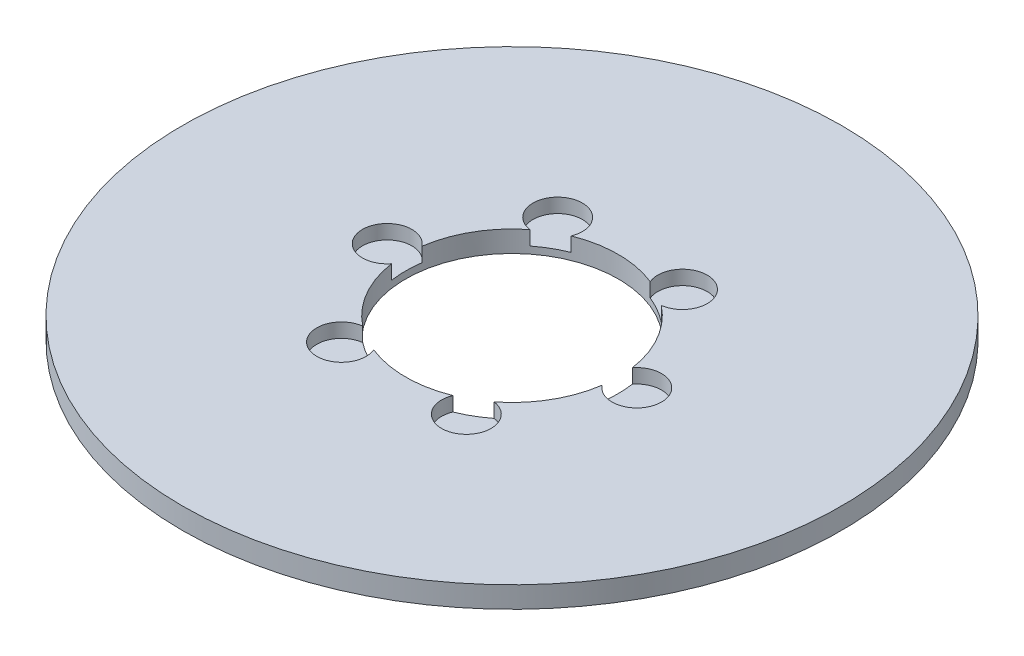
ISO-10303-21;
HEADER;
FILE_DESCRIPTION(('STEP AP214'),'2;1');
FILE_NAME('part.step','',(''),(''),'','','');
FILE_SCHEMA(('AUTOMOTIVE_DESIGN { 1 0 10303 214 1 1 1 1 }'));
ENDSEC;
DATA;
#1=APPLICATION_CONTEXT('core data for automotive mechanical design processes');
#2=APPLICATION_PROTOCOL_DEFINITION('international standard','automotive_design',2000,#1);
#3=PRODUCT_CONTEXT('',#1,'mechanical');
#4=PRODUCT('Part','Part','',(#3));
#5=PRODUCT_RELATED_PRODUCT_CATEGORY('part','',(#4));
#6=PRODUCT_DEFINITION_FORMATION('','',#4);
#7=PRODUCT_DEFINITION_CONTEXT('part definition',#1,'design');
#8=PRODUCT_DEFINITION('design','',#6,#7);
#9=PRODUCT_DEFINITION_SHAPE('','',#8);
#10=(LENGTH_UNIT() NAMED_UNIT(*) SI_UNIT(.MILLI.,.METRE.));
#11=(NAMED_UNIT(*) PLANE_ANGLE_UNIT() SI_UNIT($,.RADIAN.));
#12=(NAMED_UNIT(*) SI_UNIT($,.STERADIAN.) SOLID_ANGLE_UNIT());
#13=UNCERTAINTY_MEASURE_WITH_UNIT(LENGTH_MEASURE(1.E-05),#10,'distance_accuracy_value','');
#14=(GEOMETRIC_REPRESENTATION_CONTEXT(3) GLOBAL_UNCERTAINTY_ASSIGNED_CONTEXT((#13)) GLOBAL_UNIT_ASSIGNED_CONTEXT((#10,
#11,#12)) REPRESENTATION_CONTEXT('',''));
#15=CARTESIAN_POINT('',(0.,0.,0.));
#16=DIRECTION('',(0.,0.,1.));
#17=DIRECTION('',(1.,0.,0.));
#18=AXIS2_PLACEMENT_3D('',#15,#16,#17);
#19=CARTESIAN_POINT('',(0.,5.,0.));
#20=DIRECTION('',(0.,-1.,0.));
#21=DIRECTION('',(0.,0.,-1.));
#22=AXIS2_PLACEMENT_3D('',#19,#20,#21);
#23=CYLINDRICAL_SURFACE('',#22,77.5);
#24=CARTESIAN_POINT('',(0.,5.,0.));
#25=DIRECTION('',(0.,1.,0.));
#26=DIRECTION('',(0.,0.,1.));
#27=AXIS2_PLACEMENT_3D('',#24,#25,#26);
#28=CIRCLE('',#27,77.5);
#29=CARTESIAN_POINT('',(0.,5.,77.5));
#30=VERTEX_POINT('',#29);
#31=EDGE_CURVE('E171',#30,#30,#28,.T.);
#32=ORIENTED_EDGE('',*,*,#31,.F.);
#33=EDGE_LOOP('',(#32));
#34=FACE_BOUND('',#33,.T.);
#35=CARTESIAN_POINT('',(0.,0.,0.));
#36=DIRECTION('',(0.,1.,0.));
#37=DIRECTION('',(0.,0.,1.));
#38=AXIS2_PLACEMENT_3D('',#35,#36,#37);
#39=CIRCLE('',#38,77.5);
#40=CARTESIAN_POINT('',(0.,0.,77.5));
#41=VERTEX_POINT('',#40);
#42=EDGE_CURVE('E157',#41,#41,#39,.T.);
#43=ORIENTED_EDGE('',*,*,#42,.T.);
#44=EDGE_LOOP('',(#43));
#45=FACE_BOUND('',#44,.T.);
#46=ADVANCED_FACE('F39',(#34,#45),#23,.T.);
#47=CARTESIAN_POINT('',(0.,5.,0.));
#48=DIRECTION('',(0.,1.,0.));
#49=DIRECTION('',(0.,0.,1.));
#50=AXIS2_PLACEMENT_3D('',#47,#48,#49);
#51=PLANE('',#50);
#52=CARTESIAN_POINT('',(-14.675311446029,5.,-25.4183850414186));
#53=DIRECTION('',(0.,1.,0.));
#54=DIRECTION('',(-0.866025403784433,0.,0.50000000000001));
#55=AXIS2_PLACEMENT_3D('',#52,#53,#54);
#56=CIRCLE('',#55,5.81681843689222);
#57=CARTESIAN_POINT('',(-9.29488499058045,5.,-23.2078674809187));
#58=VERTEX_POINT('',#57);
#59=CARTESIAN_POINT('',(-15.4511603108486,5.,-19.6535402675563));
#60=VERTEX_POINT('',#59);
#61=EDGE_CURVE('E214',#58,#60,#56,.T.);
#62=ORIENTED_EDGE('',*,*,#61,.F.);
#63=CARTESIAN_POINT('',(0.,5.,0.));
#64=DIRECTION('',(0.,1.,0.));
#65=DIRECTION('',(0.,0.,1.));
#66=AXIS2_PLACEMENT_3D('',#63,#64,#65);
#67=CIRCLE('',#66,25.);
#68=CARTESIAN_POINT('',(9.29488499057996,5.,-23.2078674809189));
#69=VERTEX_POINT('',#68);
#70=EDGE_CURVE('E272',#69,#58,#67,.T.);
#71=ORIENTED_EDGE('',*,*,#70,.F.);
#72=CARTESIAN_POINT('',(14.6753114460285,5.,-25.4183850414189));
#73=DIRECTION('',(0.,1.,0.));
#74=DIRECTION('',(-0.866025403784443,0.,-0.499999999999992));
#75=AXIS2_PLACEMENT_3D('',#72,#73,#74);
#76=CIRCLE('',#75,5.81681843689222);
#77=CARTESIAN_POINT('',(15.4511603108482,5.,-19.6535402675567));
#78=VERTEX_POINT('',#77);
#79=EDGE_CURVE('E285',#78,#69,#76,.T.);
#80=ORIENTED_EDGE('',*,*,#79,.F.);
#81=CARTESIAN_POINT('',(24.7460453014285,5.,-3.55432721336227));
#82=VERTEX_POINT('',#81);
#83=EDGE_CURVE('E165',#82,#78,#67,.T.);
#84=ORIENTED_EDGE('',*,*,#83,.F.);
#85=CARTESIAN_POINT('',(29.3506228920574,5.,0.));
#86=DIRECTION('',(0.,1.,0.));
#87=DIRECTION('',(0.,0.,-1.));
#88=AXIS2_PLACEMENT_3D('',#85,#86,#87);
#89=CIRCLE('',#88,5.81681843689222);
#90=CARTESIAN_POINT('',(24.7460453014285,5.,3.55432721336227));
#91=VERTEX_POINT('',#90);
#92=EDGE_CURVE('E281',#91,#82,#89,.T.);
#93=ORIENTED_EDGE('',*,*,#92,.F.);
#94=CARTESIAN_POINT('',(15.4511603108484,5.,19.6535402675564));
#95=VERTEX_POINT('',#94);
#96=EDGE_CURVE('E160',#95,#91,#67,.T.);
#97=ORIENTED_EDGE('',*,*,#96,.F.);
#98=CARTESIAN_POINT('',(14.6753114460288,5.,25.4183850414187));
#99=DIRECTION('',(0.,1.,0.));
#100=DIRECTION('',(0.866025403784436,0.,-0.500000000000004));
#101=AXIS2_PLACEMENT_3D('',#98,#99,#100);
#102=CIRCLE('',#101,5.81681843689222);
#103=CARTESIAN_POINT('',(9.29488499058029,5.,23.2078674809187));
#104=VERTEX_POINT('',#103);
#105=EDGE_CURVE('E154',#104,#95,#102,.T.);
#106=ORIENTED_EDGE('',*,*,#105,.F.);
#107=CARTESIAN_POINT('',(-9.29488499058013,5.,23.2078674809188));
#108=VERTEX_POINT('',#107);
#109=EDGE_CURVE('E150',#108,#104,#67,.T.);
#110=ORIENTED_EDGE('',*,*,#109,.F.);
#111=CARTESIAN_POINT('',(-14.6753114460286,5.,25.4183850414188));
#112=DIRECTION('',(0.,1.,0.));
#113=DIRECTION('',(0.86602540378444,0.,0.499999999999998));
#114=AXIS2_PLACEMENT_3D('',#111,#112,#113);
#115=CIRCLE('',#114,5.81681843689222);
#116=CARTESIAN_POINT('',(-15.4511603108483,5.,19.6535402675565));
#117=VERTEX_POINT('',#116);
#118=EDGE_CURVE('E127',#117,#108,#115,.T.);
#119=ORIENTED_EDGE('',*,*,#118,.F.);
#120=CARTESIAN_POINT('',(-24.7460453014285,5.,3.55432721336227));
#121=VERTEX_POINT('',#120);
#122=EDGE_CURVE('E156',#121,#117,#67,.T.);
#123=ORIENTED_EDGE('',*,*,#122,.F.);
#124=CARTESIAN_POINT('',(-29.3506228920574,5.,0.));
#125=DIRECTION('',(0.,1.,0.));
#126=DIRECTION('',(0.,0.,1.));
#127=AXIS2_PLACEMENT_3D('',#124,#125,#126);
#128=CIRCLE('',#127,5.81681843689222);
#129=CARTESIAN_POINT('',(-24.7460453014285,5.,-3.55432721336227));
#130=VERTEX_POINT('',#129);
#131=EDGE_CURVE('E164',#130,#121,#128,.T.);
#132=ORIENTED_EDGE('',*,*,#131,.F.);
#133=EDGE_CURVE('E159',#60,#130,#67,.T.);
#134=ORIENTED_EDGE('',*,*,#133,.F.);
#135=EDGE_LOOP('',(#62,#71,#80,#84,#93,#97,#106,#110,#119,#123,#132,#134));
#136=FACE_BOUND('',#135,.T.);
#137=ORIENTED_EDGE('',*,*,#31,.T.);
#138=EDGE_LOOP('',(#137));
#139=FACE_BOUND('',#138,.T.);
#140=ADVANCED_FACE('F155',(#136,#139),#51,.T.);
#141=CARTESIAN_POINT('',(0.,0.,0.));
#142=DIRECTION('',(0.,1.,0.));
#143=DIRECTION('',(0.,0.,1.));
#144=AXIS2_PLACEMENT_3D('',#141,#142,#143);
#145=PLANE('',#144);
#146=CARTESIAN_POINT('',(0.,0.,0.));
#147=DIRECTION('',(0.,1.,0.));
#148=DIRECTION('',(0.,0.,1.));
#149=AXIS2_PLACEMENT_3D('',#146,#147,#148);
#150=CIRCLE('',#149,25.);
#151=CARTESIAN_POINT('',(0.,0.,25.));
#152=VERTEX_POINT('',#151);
#153=EDGE_CURVE('E170',#152,#152,#150,.T.);
#154=ORIENTED_EDGE('',*,*,#153,.T.);
#155=EDGE_LOOP('',(#154));
#156=FACE_BOUND('',#155,.T.);
#157=ORIENTED_EDGE('',*,*,#42,.F.);
#158=EDGE_LOOP('',(#157));
#159=FACE_BOUND('',#158,.T.);
#160=ADVANCED_FACE('F232',(#156,#159),#145,.F.);
#161=CARTESIAN_POINT('',(0.,5.,0.));
#162=DIRECTION('',(0.,-1.,0.));
#163=DIRECTION('',(0.,0.,-1.));
#164=AXIS2_PLACEMENT_3D('',#161,#162,#163);
#165=CYLINDRICAL_SURFACE('',#164,25.);
#166=DIRECTION('',(0.,1.,0.));
#167=VECTOR('',#166,1.);
#168=CARTESIAN_POINT('',(-9.29488499058045,3.32190202218176,-23.2078674809187));
#169=LINE('',#168,#167);
#170=CARTESIAN_POINT('',(-9.29488499058045,1.64380404436351,-23.2078674809187));
#171=VERTEX_POINT('',#170);
#172=EDGE_CURVE('E11',#171,#58,#169,.T.);
#173=ORIENTED_EDGE('',*,*,#172,.F.);
#174=CARTESIAN_POINT('',(0.,1.64380404436351,0.));
#175=DIRECTION('',(0.,1.,0.));
#176=DIRECTION('',(0.,0.,1.));
#177=AXIS2_PLACEMENT_3D('',#174,#175,#176);
#178=CIRCLE('',#177,25.);
#179=CARTESIAN_POINT('',(-15.4511603108486,1.64380404436351,-19.6535402675563));
#180=VERTEX_POINT('',#179);
#181=EDGE_CURVE('E209',#171,#180,#178,.T.);
#182=ORIENTED_EDGE('',*,*,#181,.T.);
#183=DIRECTION('',(0.,1.,0.));
#184=VECTOR('',#183,1.);
#185=CARTESIAN_POINT('',(-15.4511603108486,3.32190202218176,-19.6535402675563));
#186=LINE('',#185,#184);
#187=EDGE_CURVE('E46',#60,#180,#186,.F.);
#188=ORIENTED_EDGE('',*,*,#187,.F.);
#189=ORIENTED_EDGE('',*,*,#133,.T.);
#190=DIRECTION('',(0.,1.,0.));
#191=VECTOR('',#190,1.);
#192=CARTESIAN_POINT('',(-24.7460453014285,3.32190202218176,-3.55432721336227));
#193=LINE('',#192,#191);
#194=CARTESIAN_POINT('',(-24.7460453014285,1.64380404436351,-3.55432721336227));
#195=VERTEX_POINT('',#194);
#196=EDGE_CURVE('E185',#195,#130,#193,.T.);
#197=ORIENTED_EDGE('',*,*,#196,.F.);
#198=CARTESIAN_POINT('',(0.,1.64380404436351,0.));
#199=DIRECTION('',(0.,1.,0.));
#200=DIRECTION('',(0.,0.,1.));
#201=AXIS2_PLACEMENT_3D('',#198,#199,#200);
#202=CIRCLE('',#201,25.);
#203=CARTESIAN_POINT('',(-24.7460453014285,1.64380404436351,3.55432721336227));
#204=VERTEX_POINT('',#203);
#205=EDGE_CURVE('E173',#195,#204,#202,.T.);
#206=ORIENTED_EDGE('',*,*,#205,.T.);
#207=DIRECTION('',(0.,1.,0.));
#208=VECTOR('',#207,1.);
#209=CARTESIAN_POINT('',(-24.7460453014285,3.32190202218176,3.55432721336227));
#210=LINE('',#209,#208);
#211=EDGE_CURVE('E178',#121,#204,#210,.F.);
#212=ORIENTED_EDGE('',*,*,#211,.F.);
#213=ORIENTED_EDGE('',*,*,#122,.T.);
#214=DIRECTION('',(0.,1.,0.));
#215=VECTOR('',#214,1.);
#216=CARTESIAN_POINT('',(-15.4511603108483,3.32190202218176,19.6535402675565));
#217=LINE('',#216,#215);
#218=CARTESIAN_POINT('',(-15.4511603108483,1.64380404436351,19.6535402675565));
#219=VERTEX_POINT('',#218);
#220=EDGE_CURVE('E132',#219,#117,#217,.T.);
#221=ORIENTED_EDGE('',*,*,#220,.F.);
#222=CARTESIAN_POINT('',(0.,1.64380404436351,0.));
#223=DIRECTION('',(0.,1.,0.));
#224=DIRECTION('',(0.,0.,1.));
#225=AXIS2_PLACEMENT_3D('',#222,#223,#224);
#226=CIRCLE('',#225,25.);
#227=CARTESIAN_POINT('',(-9.29488499058013,1.64380404436351,23.2078674809188));
#228=VERTEX_POINT('',#227);
#229=EDGE_CURVE('E146',#219,#228,#226,.T.);
#230=ORIENTED_EDGE('',*,*,#229,.T.);
#231=DIRECTION('',(0.,1.,0.));
#232=VECTOR('',#231,1.);
#233=CARTESIAN_POINT('',(-9.29488499058012,3.32190202218176,23.2078674809188));
#234=LINE('',#233,#232);
#235=EDGE_CURVE('E128',#108,#228,#234,.F.);
#236=ORIENTED_EDGE('',*,*,#235,.F.);
#237=ORIENTED_EDGE('',*,*,#109,.T.);
#238=DIRECTION('',(0.,1.,0.));
#239=VECTOR('',#238,1.);
#240=CARTESIAN_POINT('',(9.29488499058029,3.32190202218176,23.2078674809187));
#241=LINE('',#240,#239);
#242=CARTESIAN_POINT('',(9.29488499058029,1.64380404436351,23.2078674809187));
#243=VERTEX_POINT('',#242);
#244=EDGE_CURVE('E192',#243,#104,#241,.T.);
#245=ORIENTED_EDGE('',*,*,#244,.F.);
#246=CARTESIAN_POINT('',(0.,1.64380404436351,0.));
#247=DIRECTION('',(0.,1.,0.));
#248=DIRECTION('',(0.,0.,1.));
#249=AXIS2_PLACEMENT_3D('',#246,#247,#248);
#250=CIRCLE('',#249,25.);
#251=CARTESIAN_POINT('',(15.4511603108484,1.64380404436351,19.6535402675564));
#252=VERTEX_POINT('',#251);
#253=EDGE_CURVE('E190',#243,#252,#250,.T.);
#254=ORIENTED_EDGE('',*,*,#253,.T.);
#255=DIRECTION('',(0.,1.,0.));
#256=VECTOR('',#255,1.);
#257=CARTESIAN_POINT('',(15.4511603108484,3.32190202218176,19.6535402675564));
#258=LINE('',#257,#256);
#259=EDGE_CURVE('E189',#95,#252,#258,.F.);
#260=ORIENTED_EDGE('',*,*,#259,.F.);
#261=ORIENTED_EDGE('',*,*,#96,.T.);
#262=DIRECTION('',(0.,1.,0.));
#263=VECTOR('',#262,1.);
#264=CARTESIAN_POINT('',(24.7460453014285,3.32190202218176,3.55432721336227));
#265=LINE('',#264,#263);
#266=CARTESIAN_POINT('',(24.7460453014285,1.64380404436351,3.55432721336227));
#267=VERTEX_POINT('',#266);
#268=EDGE_CURVE('E203',#267,#91,#265,.T.);
#269=ORIENTED_EDGE('',*,*,#268,.F.);
#270=CARTESIAN_POINT('',(0.,1.64380404436351,0.));
#271=DIRECTION('',(0.,1.,0.));
#272=DIRECTION('',(0.,0.,1.));
#273=AXIS2_PLACEMENT_3D('',#270,#271,#272);
#274=CIRCLE('',#273,25.);
#275=CARTESIAN_POINT('',(24.7460453014285,1.64380404436351,-3.55432721336227));
#276=VERTEX_POINT('',#275);
#277=EDGE_CURVE('E194',#267,#276,#274,.T.);
#278=ORIENTED_EDGE('',*,*,#277,.T.);
#279=DIRECTION('',(0.,1.,0.));
#280=VECTOR('',#279,1.);
#281=CARTESIAN_POINT('',(24.7460453014285,3.32190202218176,-3.55432721336227));
#282=LINE('',#281,#280);
#283=EDGE_CURVE('E196',#82,#276,#282,.F.);
#284=ORIENTED_EDGE('',*,*,#283,.F.);
#285=ORIENTED_EDGE('',*,*,#83,.T.);
#286=DIRECTION('',(0.,1.,0.));
#287=VECTOR('',#286,1.);
#288=CARTESIAN_POINT('',(15.4511603108482,3.32190202218176,-19.6535402675567));
#289=LINE('',#288,#287);
#290=CARTESIAN_POINT('',(15.4511603108482,1.64380404436351,-19.6535402675567));
#291=VERTEX_POINT('',#290);
#292=EDGE_CURVE('E208',#291,#78,#289,.T.);
#293=ORIENTED_EDGE('',*,*,#292,.F.);
#294=CARTESIAN_POINT('',(0.,1.64380404436351,0.));
#295=DIRECTION('',(0.,1.,0.));
#296=DIRECTION('',(0.,0.,1.));
#297=AXIS2_PLACEMENT_3D('',#294,#295,#296);
#298=CIRCLE('',#297,25.);
#299=CARTESIAN_POINT('',(9.29488499057996,1.64380404436351,-23.2078674809189));
#300=VERTEX_POINT('',#299);
#301=EDGE_CURVE('E201',#291,#300,#298,.T.);
#302=ORIENTED_EDGE('',*,*,#301,.T.);
#303=DIRECTION('',(0.,1.,0.));
#304=VECTOR('',#303,1.);
#305=CARTESIAN_POINT('',(9.29488499057996,3.32190202218176,-23.2078674809189));
#306=LINE('',#305,#304);
#307=EDGE_CURVE('E206',#69,#300,#306,.F.);
#308=ORIENTED_EDGE('',*,*,#307,.F.);
#309=ORIENTED_EDGE('',*,*,#70,.T.);
#310=EDGE_LOOP('',(#173,#182,#188,#189,#197,#206,#212,#213,#221,#230,#236,#237,#245,#254,#260,
#261,#269,#278,#284,#285,#293,#302,#308,#309));
#311=FACE_BOUND('',#310,.T.);
#312=ORIENTED_EDGE('',*,*,#153,.F.);
#313=EDGE_LOOP('',(#312));
#314=FACE_BOUND('',#313,.T.);
#315=ADVANCED_FACE('F145',(#311,#314),#165,.F.);
#316=CARTESIAN_POINT('',(-29.3506228920574,1.64380404436351,0.));
#317=DIRECTION('',(0.,1.,0.));
#318=DIRECTION('',(0.,0.,1.));
#319=AXIS2_PLACEMENT_3D('',#316,#317,#318);
#320=CYLINDRICAL_SURFACE('',#319,5.81681843689222);
#321=ORIENTED_EDGE('',*,*,#196,.T.);
#322=ORIENTED_EDGE('',*,*,#131,.T.);
#323=ORIENTED_EDGE('',*,*,#211,.T.);
#324=CARTESIAN_POINT('',(-29.3506228920574,1.64380404436351,0.));
#325=DIRECTION('',(0.,1.,0.));
#326=DIRECTION('',(0.,0.,1.));
#327=AXIS2_PLACEMENT_3D('',#324,#325,#326);
#328=CIRCLE('',#327,5.81681843689222);
#329=EDGE_CURVE('E168',#195,#204,#328,.T.);
#330=ORIENTED_EDGE('',*,*,#329,.F.);
#331=EDGE_LOOP('',(#321,#322,#323,#330));
#332=FACE_BOUND('',#331,.T.);
#333=ADVANCED_FACE('F243',(#332),#320,.F.);
#334=CARTESIAN_POINT('',(-29.3506228920574,1.64380404436351,0.));
#335=DIRECTION('',(0.,1.,0.));
#336=DIRECTION('',(0.,0.,1.));
#337=AXIS2_PLACEMENT_3D('',#334,#335,#336);
#338=PLANE('',#337);
#339=ORIENTED_EDGE('',*,*,#329,.T.);
#340=ORIENTED_EDGE('',*,*,#205,.F.);
#341=EDGE_LOOP('',(#339,#340));
#342=FACE_BOUND('',#341,.T.);
#343=ADVANCED_FACE('F247',(#342),#338,.T.);
#344=CARTESIAN_POINT('',(-14.6753114460286,1.64380404436351,25.4183850414188));
#345=DIRECTION('',(0.,1.,0.));
#346=DIRECTION('',(0.,0.,1.));
#347=AXIS2_PLACEMENT_3D('',#344,#345,#346);
#348=CYLINDRICAL_SURFACE('',#347,5.81681843689222);
#349=ORIENTED_EDGE('',*,*,#220,.T.);
#350=ORIENTED_EDGE('',*,*,#118,.T.);
#351=ORIENTED_EDGE('',*,*,#235,.T.);
#352=CARTESIAN_POINT('',(-14.6753114460286,1.64380404436351,25.4183850414188));
#353=DIRECTION('',(0.,1.,0.));
#354=DIRECTION('',(0.86602540378444,0.,0.499999999999998));
#355=AXIS2_PLACEMENT_3D('',#352,#353,#354);
#356=CIRCLE('',#355,5.81681843689222);
#357=EDGE_CURVE('E137',#219,#228,#356,.T.);
#358=ORIENTED_EDGE('',*,*,#357,.F.);
#359=EDGE_LOOP('',(#349,#350,#351,#358));
#360=FACE_BOUND('',#359,.T.);
#361=ADVANCED_FACE('F126',(#360),#348,.F.);
#362=CARTESIAN_POINT('',(-14.6753114460286,1.64380404436351,25.4183850414188));
#363=DIRECTION('',(0.,1.,0.));
#364=DIRECTION('',(0.86602540378444,0.,0.499999999999998));
#365=AXIS2_PLACEMENT_3D('',#362,#363,#364);
#366=PLANE('',#365);
#367=ORIENTED_EDGE('',*,*,#357,.T.);
#368=ORIENTED_EDGE('',*,*,#229,.F.);
#369=EDGE_LOOP('',(#367,#368));
#370=FACE_BOUND('',#369,.T.);
#371=ADVANCED_FACE('F254',(#370),#366,.T.);
#372=CARTESIAN_POINT('',(14.6753114460288,1.64380404436351,25.4183850414187));
#373=DIRECTION('',(0.,1.,0.));
#374=DIRECTION('',(0.,0.,1.));
#375=AXIS2_PLACEMENT_3D('',#372,#373,#374);
#376=CYLINDRICAL_SURFACE('',#375,5.81681843689222);
#377=ORIENTED_EDGE('',*,*,#244,.T.);
#378=ORIENTED_EDGE('',*,*,#105,.T.);
#379=ORIENTED_EDGE('',*,*,#259,.T.);
#380=CARTESIAN_POINT('',(14.6753114460288,1.64380404436351,25.4183850414187));
#381=DIRECTION('',(0.,1.,0.));
#382=DIRECTION('',(0.866025403784436,0.,-0.500000000000004));
#383=AXIS2_PLACEMENT_3D('',#380,#381,#382);
#384=CIRCLE('',#383,5.81681843689222);
#385=EDGE_CURVE('E138',#243,#252,#384,.T.);
#386=ORIENTED_EDGE('',*,*,#385,.F.);
#387=EDGE_LOOP('',(#377,#378,#379,#386));
#388=FACE_BOUND('',#387,.T.);
#389=ADVANCED_FACE('F260',(#388),#376,.F.);
#390=CARTESIAN_POINT('',(14.6753114460288,1.64380404436351,25.4183850414187));
#391=DIRECTION('',(0.,1.,0.));
#392=DIRECTION('',(0.866025403784436,0.,-0.500000000000004));
#393=AXIS2_PLACEMENT_3D('',#390,#391,#392);
#394=PLANE('',#393);
#395=ORIENTED_EDGE('',*,*,#385,.T.);
#396=ORIENTED_EDGE('',*,*,#253,.F.);
#397=EDGE_LOOP('',(#395,#396));
#398=FACE_BOUND('',#397,.T.);
#399=ADVANCED_FACE('F265',(#398),#394,.T.);
#400=CARTESIAN_POINT('',(29.3506228920574,1.64380404436351,0.));
#401=DIRECTION('',(0.,1.,0.));
#402=DIRECTION('',(0.,0.,1.));
#403=AXIS2_PLACEMENT_3D('',#400,#401,#402);
#404=CYLINDRICAL_SURFACE('',#403,5.81681843689222);
#405=ORIENTED_EDGE('',*,*,#268,.T.);
#406=ORIENTED_EDGE('',*,*,#92,.T.);
#407=ORIENTED_EDGE('',*,*,#283,.T.);
#408=CARTESIAN_POINT('',(29.3506228920574,1.64380404436351,0.));
#409=DIRECTION('',(0.,1.,0.));
#410=DIRECTION('',(0.,0.,-1.));
#411=AXIS2_PLACEMENT_3D('',#408,#409,#410);
#412=CIRCLE('',#411,5.81681843689222);
#413=EDGE_CURVE('E287',#267,#276,#412,.T.);
#414=ORIENTED_EDGE('',*,*,#413,.F.);
#415=EDGE_LOOP('',(#405,#406,#407,#414));
#416=FACE_BOUND('',#415,.T.);
#417=ADVANCED_FACE('F300',(#416),#404,.F.);
#418=CARTESIAN_POINT('',(29.3506228920574,1.64380404436351,0.));
#419=DIRECTION('',(0.,1.,0.));
#420=DIRECTION('',(0.,0.,-1.));
#421=AXIS2_PLACEMENT_3D('',#418,#419,#420);
#422=PLANE('',#421);
#423=ORIENTED_EDGE('',*,*,#413,.T.);
#424=ORIENTED_EDGE('',*,*,#277,.F.);
#425=EDGE_LOOP('',(#423,#424));
#426=FACE_BOUND('',#425,.T.);
#427=ADVANCED_FACE('F298',(#426),#422,.T.);
#428=CARTESIAN_POINT('',(14.6753114460285,1.64380404436351,-25.4183850414189));
#429=DIRECTION('',(0.,1.,0.));
#430=DIRECTION('',(0.,0.,1.));
#431=AXIS2_PLACEMENT_3D('',#428,#429,#430);
#432=CYLINDRICAL_SURFACE('',#431,5.81681843689222);
#433=ORIENTED_EDGE('',*,*,#292,.T.);
#434=ORIENTED_EDGE('',*,*,#79,.T.);
#435=ORIENTED_EDGE('',*,*,#307,.T.);
#436=CARTESIAN_POINT('',(14.6753114460285,1.64380404436351,-25.4183850414189));
#437=DIRECTION('',(0.,1.,0.));
#438=DIRECTION('',(-0.866025403784443,0.,-0.499999999999992));
#439=AXIS2_PLACEMENT_3D('',#436,#437,#438);
#440=CIRCLE('',#439,5.81681843689222);
#441=EDGE_CURVE('E56',#291,#300,#440,.T.);
#442=ORIENTED_EDGE('',*,*,#441,.F.);
#443=EDGE_LOOP('',(#433,#434,#435,#442));
#444=FACE_BOUND('',#443,.T.);
#445=ADVANCED_FACE('F301',(#444),#432,.F.);
#446=CARTESIAN_POINT('',(14.6753114460285,1.64380404436351,-25.4183850414189));
#447=DIRECTION('',(0.,1.,0.));
#448=DIRECTION('',(-0.866025403784443,0.,-0.499999999999992));
#449=AXIS2_PLACEMENT_3D('',#446,#447,#448);
#450=PLANE('',#449);
#451=ORIENTED_EDGE('',*,*,#441,.T.);
#452=ORIENTED_EDGE('',*,*,#301,.F.);
#453=EDGE_LOOP('',(#451,#452));
#454=FACE_BOUND('',#453,.T.);
#455=ADVANCED_FACE('F221',(#454),#450,.T.);
#456=CARTESIAN_POINT('',(-14.675311446029,1.64380404436351,-25.4183850414186));
#457=DIRECTION('',(0.,1.,0.));
#458=DIRECTION('',(0.,0.,1.));
#459=AXIS2_PLACEMENT_3D('',#456,#457,#458);
#460=CYLINDRICAL_SURFACE('',#459,5.81681843689222);
#461=ORIENTED_EDGE('',*,*,#172,.T.);
#462=ORIENTED_EDGE('',*,*,#61,.T.);
#463=ORIENTED_EDGE('',*,*,#187,.T.);
#464=CARTESIAN_POINT('',(-14.675311446029,1.64380404436351,-25.4183850414186));
#465=DIRECTION('',(0.,1.,0.));
#466=DIRECTION('',(-0.866025403784433,0.,0.50000000000001));
#467=AXIS2_PLACEMENT_3D('',#464,#465,#466);
#468=CIRCLE('',#467,5.81681843689222);
#469=EDGE_CURVE('E55',#171,#180,#468,.T.);
#470=ORIENTED_EDGE('',*,*,#469,.F.);
#471=EDGE_LOOP('',(#461,#462,#463,#470));
#472=FACE_BOUND('',#471,.T.);
#473=ADVANCED_FACE('F212',(#472),#460,.F.);
#474=CARTESIAN_POINT('',(-14.675311446029,1.64380404436351,-25.4183850414186));
#475=DIRECTION('',(0.,1.,0.));
#476=DIRECTION('',(-0.866025403784433,0.,0.50000000000001));
#477=AXIS2_PLACEMENT_3D('',#474,#475,#476);
#478=PLANE('',#477);
#479=ORIENTED_EDGE('',*,*,#469,.T.);
#480=ORIENTED_EDGE('',*,*,#181,.F.);
#481=EDGE_LOOP('',(#479,#480));
#482=FACE_BOUND('',#481,.T.);
#483=ADVANCED_FACE('F217',(#482),#478,.T.);
#484=CLOSED_SHELL('',(#46,#140,#160,#315,#333,#343,#361,#371,#389,#399,#417,#427,#445,#455,#473,#483));
#485=MANIFOLD_SOLID_BREP('B2',#484);
#486=ADVANCED_BREP_SHAPE_REPRESENTATION('',(#18,#485),#14);
#487=SHAPE_DEFINITION_REPRESENTATION(#9,#486);
ENDSEC;
END-ISO-10303-21;
